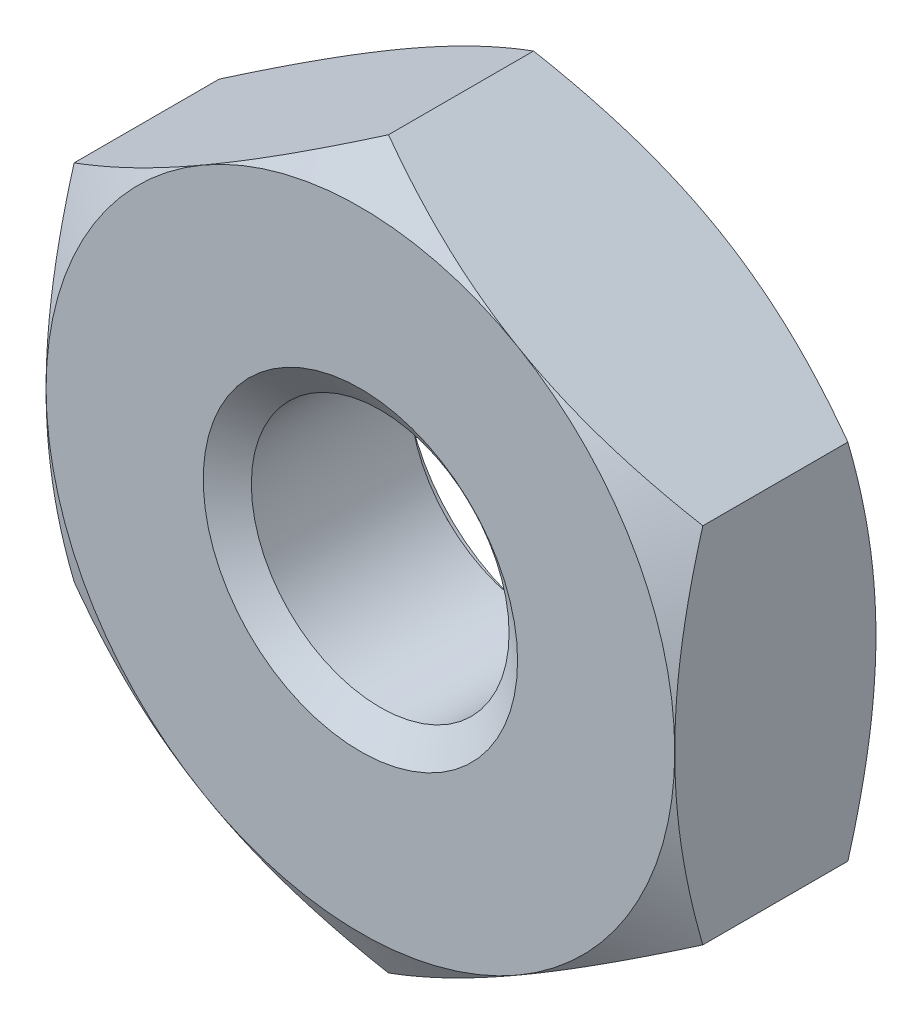
ISO-10303-21;
HEADER;
FILE_DESCRIPTION(('STEP AP214'),'2;1');
FILE_NAME('part.step','',(''),(''),'','','');
FILE_SCHEMA(('AUTOMOTIVE_DESIGN { 1 0 10303 214 1 1 1 1 }'));
ENDSEC;
DATA;
#1=APPLICATION_CONTEXT('core data for automotive mechanical design processes');
#2=APPLICATION_PROTOCOL_DEFINITION('international standard','automotive_design',2000,#1);
#3=PRODUCT_CONTEXT('',#1,'mechanical');
#4=PRODUCT('Part','Part','',(#3));
#5=PRODUCT_RELATED_PRODUCT_CATEGORY('part','',(#4));
#6=PRODUCT_DEFINITION_FORMATION('','',#4);
#7=PRODUCT_DEFINITION_CONTEXT('part definition',#1,'design');
#8=PRODUCT_DEFINITION('design','',#6,#7);
#9=PRODUCT_DEFINITION_SHAPE('','',#8);
#10=(LENGTH_UNIT() NAMED_UNIT(*) SI_UNIT(.MILLI.,.METRE.));
#11=(NAMED_UNIT(*) PLANE_ANGLE_UNIT() SI_UNIT($,.RADIAN.));
#12=(NAMED_UNIT(*) SI_UNIT($,.STERADIAN.) SOLID_ANGLE_UNIT());
#13=UNCERTAINTY_MEASURE_WITH_UNIT(LENGTH_MEASURE(1.E-05),#10,'distance_accuracy_value','');
#14=(GEOMETRIC_REPRESENTATION_CONTEXT(3) GLOBAL_UNCERTAINTY_ASSIGNED_CONTEXT((#13)) GLOBAL_UNIT_ASSIGNED_CONTEXT((#10,
#11,#12)) REPRESENTATION_CONTEXT('',''));
#15=CARTESIAN_POINT('',(0.,0.,0.));
#16=DIRECTION('',(0.,0.,1.));
#17=DIRECTION('',(1.,0.,0.));
#18=AXIS2_PLACEMENT_3D('',#15,#16,#17);
#19=CARTESIAN_POINT('',(0.,0.,-1.6));
#20=DIRECTION('',(0.,0.,1.));
#21=DIRECTION('',(1.,0.,0.));
#22=AXIS2_PLACEMENT_3D('',#19,#20,#21);
#23=CYLINDRICAL_SURFACE('',#22,1.025);
#24=CARTESIAN_POINT('',(0.,0.,-0.157546696097185));
#25=DIRECTION('',(0.,0.,1.));
#26=DIRECTION('',(1.,0.,0.));
#27=AXIS2_PLACEMENT_3D('',#24,#25,#26);
#28=CIRCLE('',#27,1.025);
#29=CARTESIAN_POINT('',(1.025,0.,-0.157546696097185));
#30=VERTEX_POINT('',#29);
#31=EDGE_CURVE('E166',#30,#30,#28,.F.);
#32=ORIENTED_EDGE('',*,*,#31,.F.);
#33=EDGE_LOOP('',(#32));
#34=FACE_BOUND('',#33,.T.);
#35=CARTESIAN_POINT('',(0.,0.,-1.41705330390281));
#36=DIRECTION('',(0.,0.,-1.));
#37=DIRECTION('',(-1.,0.,0.));
#38=AXIS2_PLACEMENT_3D('',#35,#36,#37);
#39=CIRCLE('',#38,1.025);
#40=CARTESIAN_POINT('',(-1.025,0.,-1.41705330390281));
#41=VERTEX_POINT('',#40);
#42=EDGE_CURVE('E31',#41,#41,#39,.F.);
#43=ORIENTED_EDGE('',*,*,#42,.F.);
#44=EDGE_LOOP('',(#43));
#45=FACE_BOUND('',#44,.T.);
#46=ADVANCED_FACE('F26',(#34,#45),#23,.F.);
#47=CARTESIAN_POINT('',(0.,2.88675134594814,-1.6));
#48=DIRECTION('',(0.,0.,-1.));
#49=DIRECTION('',(-1.,0.,0.));
#50=AXIS2_PLACEMENT_3D('',#47,#48,#49);
#51=PLANE('',#50);
#52=CARTESIAN_POINT('',(0.,0.,-1.6));
#53=DIRECTION('',(0.,0.,-1.));
#54=DIRECTION('',(-1.,0.,0.));
#55=AXIS2_PLACEMENT_3D('',#52,#53,#54);
#56=CIRCLE('',#55,2.5);
#57=CARTESIAN_POINT('',(-2.5,0.,-1.6));
#58=VERTEX_POINT('',#57);
#59=CARTESIAN_POINT('',(-1.25000000000002,-2.16506350946108,-1.6));
#60=VERTEX_POINT('',#59);
#61=EDGE_CURVE('E162',#58,#60,#56,.F.);
#62=ORIENTED_EDGE('',*,*,#61,.F.);
#63=CARTESIAN_POINT('',(-1.25000000000001,2.16506350946109,-1.6));
#64=VERTEX_POINT('',#63);
#65=EDGE_CURVE('E144',#64,#58,#56,.F.);
#66=ORIENTED_EDGE('',*,*,#65,.F.);
#67=CARTESIAN_POINT('',(1.25000000000003,2.16506350946108,-1.6));
#68=VERTEX_POINT('',#67);
#69=EDGE_CURVE('E161',#68,#64,#56,.F.);
#70=ORIENTED_EDGE('',*,*,#69,.F.);
#71=CARTESIAN_POINT('',(0.,0.,-1.6));
#72=DIRECTION('',(0.,0.,1.));
#73=DIRECTION('',(1.,0.,0.));
#74=AXIS2_PLACEMENT_3D('',#71,#72,#73);
#75=CIRCLE('',#74,2.5);
#76=CARTESIAN_POINT('',(2.5,0.,-1.6));
#77=VERTEX_POINT('',#76);
#78=EDGE_CURVE('E236',#77,#68,#75,.T.);
#79=ORIENTED_EDGE('',*,*,#78,.F.);
#80=CARTESIAN_POINT('',(1.25,-2.16506350946109,-1.6));
#81=VERTEX_POINT('',#80);
#82=EDGE_CURVE('E368',#81,#77,#56,.F.);
#83=ORIENTED_EDGE('',*,*,#82,.F.);
#84=EDGE_CURVE('E389',#60,#81,#56,.F.);
#85=ORIENTED_EDGE('',*,*,#84,.F.);
#86=EDGE_LOOP('',(#62,#66,#70,#79,#83,#85));
#87=FACE_BOUND('',#86,.T.);
#88=CARTESIAN_POINT('',(0.,0.,-1.6));
#89=DIRECTION('',(0.,0.,-1.));
#90=DIRECTION('',(-1.,0.,0.));
#91=AXIS2_PLACEMENT_3D('',#88,#89,#90);
#92=CIRCLE('',#91,1.25);
#93=CARTESIAN_POINT('',(-1.25,0.,-1.6));
#94=VERTEX_POINT('',#93);
#95=EDGE_CURVE('E169',#94,#94,#92,.F.);
#96=ORIENTED_EDGE('',*,*,#95,.T.);
#97=EDGE_LOOP('',(#96));
#98=FACE_BOUND('',#97,.T.);
#99=ADVANCED_FACE('F241',(#87,#98),#51,.T.);
#100=CARTESIAN_POINT('',(0.,2.88675134594814,0.));
#101=DIRECTION('',(0.,0.,-1.));
#102=DIRECTION('',(-1.,0.,0.));
#103=AXIS2_PLACEMENT_3D('',#100,#101,#102);
#104=PLANE('',#103);
#105=CARTESIAN_POINT('',(0.,0.,0.));
#106=DIRECTION('',(0.,0.,-1.));
#107=DIRECTION('',(-1.,0.,0.));
#108=AXIS2_PLACEMENT_3D('',#105,#106,#107);
#109=CIRCLE('',#108,2.5);
#110=CARTESIAN_POINT('',(-2.5,0.,0.));
#111=VERTEX_POINT('',#110);
#112=CARTESIAN_POINT('',(-1.25000000000001,2.16506350946109,0.));
#113=VERTEX_POINT('',#112);
#114=EDGE_CURVE('E11',#111,#113,#109,.T.);
#115=ORIENTED_EDGE('',*,*,#114,.F.);
#116=CARTESIAN_POINT('',(-1.25000000000002,-2.16506350946108,0.));
#117=VERTEX_POINT('',#116);
#118=EDGE_CURVE('E38',#117,#111,#109,.T.);
#119=ORIENTED_EDGE('',*,*,#118,.F.);
#120=CARTESIAN_POINT('',(1.25,-2.16506350946109,0.));
#121=VERTEX_POINT('',#120);
#122=EDGE_CURVE('E165',#121,#117,#109,.T.);
#123=ORIENTED_EDGE('',*,*,#122,.F.);
#124=CARTESIAN_POINT('',(2.5,0.,0.));
#125=VERTEX_POINT('',#124);
#126=EDGE_CURVE('E334',#125,#121,#109,.T.);
#127=ORIENTED_EDGE('',*,*,#126,.F.);
#128=CARTESIAN_POINT('',(0.,0.,0.));
#129=DIRECTION('',(0.,0.,1.));
#130=DIRECTION('',(1.,0.,0.));
#131=AXIS2_PLACEMENT_3D('',#128,#129,#130);
#132=CIRCLE('',#131,2.5);
#133=CARTESIAN_POINT('',(1.25000000000003,2.16506350946108,0.));
#134=VERTEX_POINT('',#133);
#135=EDGE_CURVE('E120',#125,#134,#132,.T.);
#136=ORIENTED_EDGE('',*,*,#135,.T.);
#137=EDGE_CURVE('E36',#113,#134,#109,.T.);
#138=ORIENTED_EDGE('',*,*,#137,.F.);
#139=EDGE_LOOP('',(#115,#119,#123,#127,#136,#138));
#140=FACE_BOUND('',#139,.T.);
#141=CARTESIAN_POINT('',(0.,0.,0.));
#142=DIRECTION('',(0.,0.,1.));
#143=DIRECTION('',(1.,0.,0.));
#144=AXIS2_PLACEMENT_3D('',#141,#142,#143);
#145=CIRCLE('',#144,1.25);
#146=CARTESIAN_POINT('',(1.25,0.,0.));
#147=VERTEX_POINT('',#146);
#148=EDGE_CURVE('E168',#147,#147,#145,.T.);
#149=ORIENTED_EDGE('',*,*,#148,.F.);
#150=EDGE_LOOP('',(#149));
#151=FACE_BOUND('',#150,.T.);
#152=ADVANCED_FACE('F294',(#140,#151),#104,.F.);
#153=CARTESIAN_POINT('',(0.,2.88675134594814,-1.6));
#154=DIRECTION('',(-0.500000000000003,0.866025403784437,0.));
#155=DIRECTION('',(-0.866025403784437,-0.500000000000003,0.));
#156=AXIS2_PLACEMENT_3D('',#153,#154,#155);
#157=PLANE('',#156);
#158=DIRECTION('',(0.,0.,1.));
#159=VECTOR('',#158,1.);
#160=CARTESIAN_POINT('',(-2.5,1.44337567297406,-1.6));
#161=LINE('',#160,#159);
#162=CARTESIAN_POINT('',(-2.5,1.44337567297409,-1.3767090063074));
#163=VERTEX_POINT('',#162);
#164=CARTESIAN_POINT('',(-2.5,1.44337567297406,-0.223290993692597));
#165=VERTEX_POINT('',#164);
#166=EDGE_CURVE('E156',#163,#165,#161,.T.);
#167=ORIENTED_EDGE('',*,*,#166,.T.);
#168=CARTESIAN_POINT('',(-2.5002,1.44326020292022,-0.223357664359103));
#169=CARTESIAN_POINT('',(-2.39033676526513,1.50668977106844,-0.186721620107621));
#170=CARTESIAN_POINT('',(-2.27952520010347,1.57066685804385,-0.153402218965052));
#171=CARTESIAN_POINT('',(-2.05598316653395,1.69972891130041,-0.095242285557855));
#172=CARTESIAN_POINT('',(-1.94324872547161,1.76481617119469,-0.070422329147736));
#173=CARTESIAN_POINT('',(-1.71917700612473,1.89418403867739,-0.0317856514410506));
#174=CARTESIAN_POINT('',(-1.60787420823263,1.95844473900196,-0.0177117961856379));
#175=CARTESIAN_POINT('',(-1.38474477253167,2.08726857876804,-0.0009091523527495));
#176=CARTESIAN_POINT('',(-1.27291894598578,2.15183124982666,0.00183354879637425));
#177=CARTESIAN_POINT('',(-1.06395802444848,2.27247489412633,-0.00386576000805269));
#178=CARTESIAN_POINT('',(-0.966791682442271,2.32857390783979,-0.0109083943818611));
#179=CARTESIAN_POINT('',(-0.773092050288997,2.44040644260542,-0.0332314191249424));
#180=CARTESIAN_POINT('',(-0.676559430340266,2.4961395767184,-0.0485194384402671));
#181=CARTESIAN_POINT('',(-0.48246027825952,2.60820277442169,-0.0867390938444209));
#182=CARTESIAN_POINT('',(-0.384918318217854,2.66451865130903,-0.109832776125518));
#183=CARTESIAN_POINT('',(-0.191289391923907,2.77631036402774,-0.162246656577915));
#184=CARTESIAN_POINT('',(-0.0951999441138142,2.83178763258718,-0.191554535624551));
#185=CARTESIAN_POINT('',(0.000200000000011263,2.88686681600198,-0.223357664359112));
#186=B_SPLINE_CURVE_WITH_KNOTS('',3,(#168,#169,#170,#171,#172,#173,#174,#175,#176,#177,#178,
#179,#180,#181,#182,#183,#184,#185),.UNSPECIFIED.,.F.,.F.,(4,2,2,2,2,2,2,2,4),(0.,
0.396285827362225,0.793524330152048,1.18093086852114,1.56786160134475,1.90479741793733,
2.24204551660463,2.58677531536757,2.93082800105258),.UNSPECIFIED.);
#187=EDGE_CURVE('E125',#165,#113,#186,.T.);
#188=ORIENTED_EDGE('',*,*,#187,.T.);
#189=CARTESIAN_POINT('',(0.,2.88675134594814,-0.223290993692605));
#190=VERTEX_POINT('',#189);
#191=EDGE_CURVE('E45',#113,#190,#186,.T.);
#192=ORIENTED_EDGE('',*,*,#191,.T.);
#193=DIRECTION('',(0.,0.,1.));
#194=VECTOR('',#193,1.);
#195=CARTESIAN_POINT('',(0.,2.88675134594814,-1.6));
#196=LINE('',#195,#194);
#197=CARTESIAN_POINT('',(0.,2.88675134594814,-1.3767090063074));
#198=VERTEX_POINT('',#197);
#199=EDGE_CURVE('E141',#198,#190,#196,.T.);
#200=ORIENTED_EDGE('',*,*,#199,.F.);
#201=CARTESIAN_POINT('',(-2.5002,1.44326020292022,-1.3766423356409));
#202=CARTESIAN_POINT('',(-2.39033676526513,1.50668977106844,-1.41327837989238));
#203=CARTESIAN_POINT('',(-2.27952520010347,1.57066685804385,-1.44659778103495));
#204=CARTESIAN_POINT('',(-2.05598316653395,1.69972891130041,-1.50475771444215));
#205=CARTESIAN_POINT('',(-1.94324872547161,1.76481617119469,-1.52957767085226));
#206=CARTESIAN_POINT('',(-1.71917700612473,1.89418403867739,-1.56821434855895));
#207=CARTESIAN_POINT('',(-1.60787420823263,1.95844473900196,-1.58228820381436));
#208=CARTESIAN_POINT('',(-1.38474477253167,2.08726857876804,-1.59909084764725));
#209=CARTESIAN_POINT('',(-1.27291894598578,2.15183124982666,-1.60183354879637));
#210=CARTESIAN_POINT('',(-1.06395802444848,2.27247489412633,-1.59613423999195));
#211=CARTESIAN_POINT('',(-0.966791682442271,2.32857390783979,-1.58909160561814));
#212=CARTESIAN_POINT('',(-0.773092050288997,2.44040644260542,-1.56676858087506));
#213=CARTESIAN_POINT('',(-0.676559430340266,2.4961395767184,-1.55148056155973));
#214=CARTESIAN_POINT('',(-0.48246027825952,2.60820277442169,-1.51326090615558));
#215=CARTESIAN_POINT('',(-0.384918318217854,2.66451865130903,-1.49016722387448));
#216=CARTESIAN_POINT('',(-0.191289391923907,2.77631036402774,-1.43775334342209));
#217=CARTESIAN_POINT('',(-0.0951999441138142,2.83178763258718,-1.40844546437545));
#218=CARTESIAN_POINT('',(0.000200000000011264,2.88686681600198,-1.37664233564089));
#219=B_SPLINE_CURVE_WITH_KNOTS('',3,(#201,#202,#203,#204,#205,#206,#207,#208,#209,#210,#211,
#212,#213,#214,#215,#216,#217,#218),.UNSPECIFIED.,.F.,.F.,(4,2,2,2,2,2,2,2,4),(0.,
0.396285827362226,0.793524330152048,1.18093086852114,1.56786160134475,1.90479741793733,
2.24204551660463,2.58677531536757,2.93082800105258),.UNSPECIFIED.);
#220=EDGE_CURVE('E159',#64,#198,#219,.T.);
#221=ORIENTED_EDGE('',*,*,#220,.F.);
#222=EDGE_CURVE('E251',#163,#64,#219,.T.);
#223=ORIENTED_EDGE('',*,*,#222,.F.);
#224=EDGE_LOOP('',(#167,#188,#192,#200,#221,#223));
#225=FACE_BOUND('',#224,.T.);
#226=ADVANCED_FACE('F28',(#225),#157,.T.);
#227=CARTESIAN_POINT('',(2.5,1.44337567297404,-1.6));
#228=DIRECTION('',(0.50000000000001,0.866025403784433,0.));
#229=DIRECTION('',(-0.866025403784433,0.50000000000001,0.));
#230=AXIS2_PLACEMENT_3D('',#227,#228,#229);
#231=PLANE('',#230);
#232=ORIENTED_EDGE('',*,*,#199,.T.);
#233=CARTESIAN_POINT('',(-0.00019999999998845,2.88686681600198,-0.223357664359111));
#234=CARTESIAN_POINT('',(0.109663234734882,2.82343724785375,-0.186721620107629));
#235=CARTESIAN_POINT('',(0.220474799896536,2.75946016087835,-0.153402218965059));
#236=CARTESIAN_POINT('',(0.444016833466059,2.63039810762178,-0.0952422855578602));
#237=CARTESIAN_POINT('',(0.556751274528397,2.5653108477275,-0.0704223291477404));
#238=CARTESIAN_POINT('',(0.780822993875276,2.43594298024479,-0.0317856514410532));
#239=CARTESIAN_POINT('',(0.892125791767383,2.37168227992022,-0.0177117961856395));
#240=CARTESIAN_POINT('',(1.11525522746834,2.24285844015414,-0.000909152352749658));
#241=CARTESIAN_POINT('',(1.22708105401423,2.17829576909552,0.00183354879637448));
#242=CARTESIAN_POINT('',(1.43604197555152,2.05765212479585,-0.00386576000805121));
#243=CARTESIAN_POINT('',(1.53320831755773,2.00155311108239,-0.0109083943818587));
#244=CARTESIAN_POINT('',(1.72690794971101,1.88972057631676,-0.0332314191249383));
#245=CARTESIAN_POINT('',(1.82344056965973,1.83398744220378,-0.0485194384402623));
#246=CARTESIAN_POINT('',(2.01753972174048,1.72192424450048,-0.0867390938444143));
#247=CARTESIAN_POINT('',(2.11508168178214,1.66560836761314,-0.109832776125511));
#248=CARTESIAN_POINT('',(2.30871060807609,1.55381665489443,-0.162246656577906));
#249=CARTESIAN_POINT('',(2.40480005588618,1.49833938633499,-0.191554535624541));
#250=CARTESIAN_POINT('',(2.5002,1.4432602029202,-0.2233576643591));
#251=B_SPLINE_CURVE_WITH_KNOTS('',3,(#233,#234,#235,#236,#237,#238,#239,#240,#241,#242,#243,
#244,#245,#246,#247,#248,#249,#250),.UNSPECIFIED.,.F.,.F.,(4,2,2,2,2,2,2,2,4),(0.,
0.396285827362227,0.793524330152052,1.18093086852114,1.56786160134476,1.90479741793733,
2.24204551660463,2.58677531536757,2.93082800105257),.UNSPECIFIED.);
#252=EDGE_CURVE('E135',#190,#134,#251,.T.);
#253=ORIENTED_EDGE('',*,*,#252,.T.);
#254=CARTESIAN_POINT('',(2.5,1.44337567297408,-0.223290993692605));
#255=VERTEX_POINT('',#254);
#256=EDGE_CURVE('E52',#134,#255,#251,.T.);
#257=ORIENTED_EDGE('',*,*,#256,.T.);
#258=DIRECTION('',(0.,0.,1.));
#259=VECTOR('',#258,1.);
#260=CARTESIAN_POINT('',(2.5,1.44337567297404,-1.6));
#261=LINE('',#260,#259);
#262=CARTESIAN_POINT('',(2.5,1.44337567297408,-1.3767090063074));
#263=VERTEX_POINT('',#262);
#264=EDGE_CURVE('E134',#263,#255,#261,.T.);
#265=ORIENTED_EDGE('',*,*,#264,.F.);
#266=CARTESIAN_POINT('',(-0.00019999999998845,2.88686681600198,-1.37664233564089));
#267=CARTESIAN_POINT('',(0.109663234734882,2.82343724785375,-1.41327837989237));
#268=CARTESIAN_POINT('',(0.220474799896536,2.75946016087835,-1.44659778103494));
#269=CARTESIAN_POINT('',(0.444016833466058,2.63039810762178,-1.50475771444214));
#270=CARTESIAN_POINT('',(0.556751274528396,2.5653108477275,-1.52957767085226));
#271=CARTESIAN_POINT('',(0.780822993875275,2.43594298024479,-1.56821434855895));
#272=CARTESIAN_POINT('',(0.892125791767383,2.37168227992022,-1.58228820381436));
#273=CARTESIAN_POINT('',(1.11525522746834,2.24285844015414,-1.59909084764725));
#274=CARTESIAN_POINT('',(1.22708105401423,2.17829576909552,-1.60183354879638));
#275=CARTESIAN_POINT('',(1.43604197555152,2.05765212479585,-1.59613423999195));
#276=CARTESIAN_POINT('',(1.53320831755773,2.00155311108239,-1.58909160561814));
#277=CARTESIAN_POINT('',(1.72690794971101,1.88972057631676,-1.56676858087506));
#278=CARTESIAN_POINT('',(1.82344056965974,1.83398744220378,-1.55148056155974));
#279=CARTESIAN_POINT('',(2.01753972174048,1.72192424450048,-1.51326090615559));
#280=CARTESIAN_POINT('',(2.11508168178214,1.66560836761314,-1.49016722387449));
#281=CARTESIAN_POINT('',(2.30871060807609,1.55381665489443,-1.4377533434221));
#282=CARTESIAN_POINT('',(2.40480005588618,1.49833938633499,-1.40844546437546));
#283=CARTESIAN_POINT('',(2.5002,1.4432602029202,-1.3766423356409));
#284=B_SPLINE_CURVE_WITH_KNOTS('',3,(#266,#267,#268,#269,#270,#271,#272,#273,#274,#275,#276,
#277,#278,#279,#280,#281,#282,#283),.UNSPECIFIED.,.F.,.F.,(4,2,2,2,2,2,2,2,4),(0.,
0.396285827362227,0.793524330152051,1.18093086852114,1.56786160134476,1.90479741793733,
2.24204551660463,2.58677531536757,2.93082800105257),.UNSPECIFIED.);
#285=EDGE_CURVE('E245',#68,#263,#284,.T.);
#286=ORIENTED_EDGE('',*,*,#285,.F.);
#287=EDGE_CURVE('E250',#198,#68,#284,.T.);
#288=ORIENTED_EDGE('',*,*,#287,.F.);
#289=EDGE_LOOP('',(#232,#253,#257,#265,#286,#288));
#290=FACE_BOUND('',#289,.T.);
#291=ADVANCED_FACE('F132',(#290),#231,.T.);
#292=CARTESIAN_POINT('',(2.5,1.44337567297404,-1.6));
#293=DIRECTION('',(-1.,0.,0.));
#294=DIRECTION('',(0.,0.,1.));
#295=AXIS2_PLACEMENT_3D('',#292,#293,#294);
#296=PLANE('',#295);
#297=CARTESIAN_POINT('',(2.5,-3.82804499372437,-1.1963167632754));
#298=CARTESIAN_POINT('',(2.5,-3.71828085649177,-1.14327266922931));
#299=CARTESIAN_POINT('',(2.5,-3.60825720059558,-1.09075587737962));
#300=CARTESIAN_POINT('',(2.5,-3.38755052986225,-0.98707821674823));
#301=CARTESIAN_POINT('',(2.5,-3.27686740487458,-0.935917582729522));
#302=CARTESIAN_POINT('',(2.5,-3.05410357303962,-0.834984039411602));
#303=CARTESIAN_POINT('',(2.5,-2.94201849305855,-0.785220746914403));
#304=CARTESIAN_POINT('',(2.5,-2.71692709217043,-0.68783161588769));
#305=CARTESIAN_POINT('',(2.5,-2.60392081964714,-0.640205665942517));
#306=CARTESIAN_POINT('',(2.5,-2.37540441715614,-0.547094156496482));
#307=CARTESIAN_POINT('',(2.5,-2.25988058014234,-0.501642052634909));
#308=CARTESIAN_POINT('',(2.5,-2.02747029246859,-0.414297644349644));
#309=CARTESIAN_POINT('',(2.5,-1.91058369184879,-0.372405735979072));
#310=CARTESIAN_POINT('',(2.5,-1.6755019890861,-0.293307342769308));
#311=CARTESIAN_POINT('',(2.5,-1.55731027320533,-0.256090896739906));
#312=CARTESIAN_POINT('',(2.5,-1.3192465914741,-0.187552097840324));
#313=CARTESIAN_POINT('',(2.5,-1.19937516991096,-0.156227881047977));
#314=CARTESIAN_POINT('',(2.5,-0.95787020436378,-0.100994246846283));
#315=CARTESIAN_POINT('',(2.5,-0.836236200197841,-0.0770868037228439));
#316=CARTESIAN_POINT('',(2.5,-0.591501703670376,-0.0382963974514701));
#317=CARTESIAN_POINT('',(2.5,-0.468401210012389,-0.0234134422823167));
#318=CARTESIAN_POINT('',(2.5,-0.222157493517493,-0.00398863321840113));
#319=CARTESIAN_POINT('',(2.5,-0.0990195694337861,0.000618687975648278));
#320=CARTESIAN_POINT('',(2.5,0.14717005350464,-0.000752541484248236));
#321=CARTESIAN_POINT('',(2.5,0.2702217664451,-0.00672834425959449));
#322=CARTESIAN_POINT('',(2.5,0.480350397015922,-0.0255492091334931));
#323=CARTESIAN_POINT('',(2.5,0.567659136488612,-0.035943310027442));
#324=CARTESIAN_POINT('',(2.5,0.741602181646835,-0.0613833814666798));
#325=CARTESIAN_POINT('',(2.5,0.828236378756311,-0.076430085661526));
#326=CARTESIAN_POINT('',(2.5,1.08705653408104,-0.12775941934389));
#327=CARTESIAN_POINT('',(2.5,1.2580293158045,-0.170218054015716));
#328=CARTESIAN_POINT('',(2.5,1.51386408134076,-0.243447724573247));
#329=CARTESIAN_POINT('',(2.5,1.60005960225961,-0.269821213632267));
#330=CARTESIAN_POINT('',(2.5,1.77155099438377,-0.325177862642346));
#331=CARTESIAN_POINT('',(2.5,1.85684744139723,-0.354159222616814));
#332=CARTESIAN_POINT('',(2.5,2.02618400322713,-0.414128561987673));
#333=CARTESIAN_POINT('',(2.5,2.11022848716774,-0.445104328595931));
#334=CARTESIAN_POINT('',(2.5,2.27766538220571,-0.508873971119182));
#335=CARTESIAN_POINT('',(2.5,2.36105751399617,-0.541668581852099));
#336=CARTESIAN_POINT('',(2.5,2.44414811866678,-0.575193129088613));
#337=B_SPLINE_CURVE_WITH_KNOTS('',3,(#297,#298,#299,#300,#301,#302,#303,#304,#305,#306,#307,
#308,#309,#310,#311,#312,#313,#314,#315,#316,#317,#318,#319,#320,#321,#322,#323,#324,#325,#326,
#327,#328,#329,#330,#331,#332,#333,#334,#335,#336),.UNSPECIFIED.,.F.,.F.,(4,2,2,2,2,2,2,2,2,2,2,
2,2,2,2,2,2,2,2,4),(0.,0.365732370332671,0.731527644124545,1.09941621653744,1.46728558928017,
1.83967125623428,2.21209829506681,2.58371790436001,2.9552197586967,3.32682041917404,
3.69842140819259,4.06764803658774,4.4367788103743,4.70042588015952,4.96411454456777,
5.49188432099896,5.76228301186059,6.03249648197689,6.3011890091436,6.56999089095297),.UNSPECIFIED.);
#338=CARTESIAN_POINT('',(2.49999999999998,-1.44337567297411,-0.223290993692605));
#339=VERTEX_POINT('',#338);
#340=EDGE_CURVE('E127',#339,#125,#337,.T.);
#341=ORIENTED_EDGE('',*,*,#340,.F.);
#342=DIRECTION('',(0.,0.,1.));
#343=VECTOR('',#342,1.);
#344=CARTESIAN_POINT('',(2.5,-1.4433756729741,-1.6));
#345=LINE('',#344,#343);
#346=CARTESIAN_POINT('',(2.49999999999998,-1.44337567297411,-1.3767090063074));
#347=VERTEX_POINT('',#346);
#348=EDGE_CURVE('E142',#347,#339,#345,.T.);
#349=ORIENTED_EDGE('',*,*,#348,.F.);
#350=CARTESIAN_POINT('',(2.5,-3.82804499372437,-0.4036832367246));
#351=CARTESIAN_POINT('',(2.5,-3.71828085649177,-0.456727330770687));
#352=CARTESIAN_POINT('',(2.5,-3.60825720059558,-0.509244122620375));
#353=CARTESIAN_POINT('',(2.5,-3.38755052986225,-0.61292178325177));
#354=CARTESIAN_POINT('',(2.5,-3.27686740487459,-0.664082417270478));
#355=CARTESIAN_POINT('',(2.5,-3.05410357303963,-0.765015960588398));
#356=CARTESIAN_POINT('',(2.5,-2.94201849305855,-0.814779253085597));
#357=CARTESIAN_POINT('',(2.5,-2.71692709217043,-0.912168384112309));
#358=CARTESIAN_POINT('',(2.5,-2.60392081964715,-0.959794334057482));
#359=CARTESIAN_POINT('',(2.5,-2.37540441715614,-1.05290584350352));
#360=CARTESIAN_POINT('',(2.5,-2.25988058014235,-1.09835794736509));
#361=CARTESIAN_POINT('',(2.5,-2.02747029246859,-1.18570235565036));
#362=CARTESIAN_POINT('',(2.5,-1.91058369184879,-1.22759426402093));
#363=CARTESIAN_POINT('',(2.5,-1.6755019890861,-1.30669265723069));
#364=CARTESIAN_POINT('',(2.5,-1.55731027320534,-1.34390910326009));
#365=CARTESIAN_POINT('',(2.5,-1.3192465914741,-1.41244790215968));
#366=CARTESIAN_POINT('',(2.5,-1.19937516991096,-1.44377211895202));
#367=CARTESIAN_POINT('',(2.5,-0.957870204363781,-1.49900575315372));
#368=CARTESIAN_POINT('',(2.5,-0.836236200197841,-1.52291319627716));
#369=CARTESIAN_POINT('',(2.5,-0.591501703670376,-1.56170360254853));
#370=CARTESIAN_POINT('',(2.5,-0.468401210012388,-1.57658655771768));
#371=CARTESIAN_POINT('',(2.5,-0.222157493517493,-1.5960113667816));
#372=CARTESIAN_POINT('',(2.5,-0.0990195694337857,-1.60061868797565));
#373=CARTESIAN_POINT('',(2.5,0.14717005350464,-1.59924745851575));
#374=CARTESIAN_POINT('',(2.5,0.270221766445101,-1.59327165574041));
#375=CARTESIAN_POINT('',(2.5,0.480350397015922,-1.57445079086651));
#376=CARTESIAN_POINT('',(2.5,0.567659136488612,-1.56405668997256));
#377=CARTESIAN_POINT('',(2.5,0.741602181646835,-1.53861661853332));
#378=CARTESIAN_POINT('',(2.5,0.828236378756311,-1.52356991433847));
#379=CARTESIAN_POINT('',(2.5,1.08705653408104,-1.47224058065611));
#380=CARTESIAN_POINT('',(2.5,1.2580293158045,-1.42978194598428));
#381=CARTESIAN_POINT('',(2.5,1.51386408134076,-1.35655227542675));
#382=CARTESIAN_POINT('',(2.5,1.6000596022596,-1.33017878636773));
#383=CARTESIAN_POINT('',(2.5,1.77155099438377,-1.27482213735766));
#384=CARTESIAN_POINT('',(2.5,1.85684744139723,-1.24584077738319));
#385=CARTESIAN_POINT('',(2.5,2.02618400322713,-1.18587143801233));
#386=CARTESIAN_POINT('',(2.5,2.11022848716773,-1.15489567140407));
#387=CARTESIAN_POINT('',(2.5,2.27766538220571,-1.09112602888082));
#388=CARTESIAN_POINT('',(2.5,2.36105751399617,-1.0583314181479));
#389=CARTESIAN_POINT('',(2.5,2.44414811866678,-1.02480687091139));
#390=B_SPLINE_CURVE_WITH_KNOTS('',3,(#350,#351,#352,#353,#354,#355,#356,#357,#358,#359,#360,
#361,#362,#363,#364,#365,#366,#367,#368,#369,#370,#371,#372,#373,#374,#375,#376,#377,#378,#379,
#380,#381,#382,#383,#384,#385,#386,#387,#388,#389),.UNSPECIFIED.,.F.,.F.,(4,2,2,2,2,2,2,2,2,2,2,
2,2,2,2,2,2,2,2,4),(0.,0.365732370332671,0.731527644124544,1.09941621653744,1.46728558928017,
1.83967125623428,2.21209829506681,2.58371790436001,2.9552197586967,3.32682041917404,
3.69842140819259,4.06764803658774,4.4367788103743,4.70042588015952,4.96411454456777,
5.49188432099896,5.76228301186059,6.03249648197689,6.3011890091436,6.56999089095297),.UNSPECIFIED.);
#391=EDGE_CURVE('E257',#347,#77,#390,.T.);
#392=ORIENTED_EDGE('',*,*,#391,.T.);
#393=EDGE_CURVE('E140',#77,#263,#390,.T.);
#394=ORIENTED_EDGE('',*,*,#393,.T.);
#395=ORIENTED_EDGE('',*,*,#264,.T.);
#396=EDGE_CURVE('E117',#125,#255,#337,.T.);
#397=ORIENTED_EDGE('',*,*,#396,.F.);
#398=EDGE_LOOP('',(#341,#349,#392,#394,#395,#397));
#399=FACE_BOUND('',#398,.T.);
#400=ADVANCED_FACE('F138',(#399),#296,.F.);
#401=CARTESIAN_POINT('',(0.,-2.88675134594817,-1.6));
#402=DIRECTION('',(0.500000000000001,-0.866025403784438,0.));
#403=DIRECTION('',(0.866025403784438,0.500000000000001,0.));
#404=AXIS2_PLACEMENT_3D('',#401,#402,#403);
#405=PLANE('',#404);
#406=ORIENTED_EDGE('',*,*,#348,.T.);
#407=CARTESIAN_POINT('',(2.5002,-1.44326020292026,-0.223357664359118));
#408=CARTESIAN_POINT('',(2.39033676526513,-1.50668977106848,-0.186721620107636));
#409=CARTESIAN_POINT('',(2.27952520010348,-1.57066685804389,-0.153402218965067));
#410=CARTESIAN_POINT('',(2.05598316653395,-1.69972891130045,-0.0952422855578711));
#411=CARTESIAN_POINT('',(1.94324872547161,-1.76481617119474,-0.0704223291477528));
#412=CARTESIAN_POINT('',(1.71917700612473,-1.89418403867744,-0.0317856514410685));
#413=CARTESIAN_POINT('',(1.60787420823262,-1.95844473900201,-0.0177117961856562));
#414=CARTESIAN_POINT('',(1.38474477253166,-2.08726857876809,-0.000909152352769273));
#415=CARTESIAN_POINT('',(1.27291894598577,-2.15183124982671,0.00183354879635338));
#416=CARTESIAN_POINT('',(1.06395802444847,-2.27247489412638,-0.00386576000807509));
#417=CARTESIAN_POINT('',(0.966791682442263,-2.32857390783984,-0.0109083943818838));
#418=CARTESIAN_POINT('',(0.773092050288992,-2.44040644260546,-0.0332314191249656));
#419=CARTESIAN_POINT('',(0.676559430340263,-2.49613957671844,-0.0485194384402905));
#420=CARTESIAN_POINT('',(0.482460278259519,-2.60820277442173,-0.0867390938444441));
#421=CARTESIAN_POINT('',(0.384918318217855,-2.66451865130907,-0.109832776125541));
#422=CARTESIAN_POINT('',(0.191289391923911,-2.77631036402778,-0.162246656577937));
#423=CARTESIAN_POINT('',(0.09519994411382,-2.83178763258722,-0.191554535624572));
#424=CARTESIAN_POINT('',(-0.000200000000004054,-2.88686681600201,-0.223357664359131));
#425=B_SPLINE_CURVE_WITH_KNOTS('',3,(#407,#408,#409,#410,#411,#412,#413,#414,#415,#416,#417,
#418,#419,#420,#421,#422,#423,#424),.UNSPECIFIED.,.F.,.F.,(4,2,2,2,2,2,2,2,4),(0.,
0.396285827362229,0.793524330152055,1.18093086852115,1.56786160134476,1.90479741793734,
2.24204551660464,2.58677531536757,2.93082800105257),.UNSPECIFIED.);
#426=EDGE_CURVE('E337',#339,#121,#425,.T.);
#427=ORIENTED_EDGE('',*,*,#426,.T.);
#428=CARTESIAN_POINT('',(0.,-2.88675134594814,-0.223290993692605));
#429=VERTEX_POINT('',#428);
#430=EDGE_CURVE('E217',#121,#429,#425,.T.);
#431=ORIENTED_EDGE('',*,*,#430,.T.);
#432=DIRECTION('',(0.,0.,1.));
#433=VECTOR('',#432,1.);
#434=CARTESIAN_POINT('',(0.,-2.88675134594817,-1.6));
#435=LINE('',#434,#433);
#436=CARTESIAN_POINT('',(0.,-2.88675134594814,-1.3767090063074));
#437=VERTEX_POINT('',#436);
#438=EDGE_CURVE('E147',#437,#429,#435,.T.);
#439=ORIENTED_EDGE('',*,*,#438,.F.);
#440=CARTESIAN_POINT('',(2.5002,-1.44326020292026,-1.37664233564088));
#441=CARTESIAN_POINT('',(2.39033676526513,-1.50668977106848,-1.41327837989236));
#442=CARTESIAN_POINT('',(2.27952520010348,-1.57066685804389,-1.44659778103493));
#443=CARTESIAN_POINT('',(2.05598316653395,-1.69972891130045,-1.50475771444213));
#444=CARTESIAN_POINT('',(1.94324872547161,-1.76481617119474,-1.52957767085225));
#445=CARTESIAN_POINT('',(1.71917700612473,-1.89418403867744,-1.56821434855893));
#446=CARTESIAN_POINT('',(1.60787420823262,-1.95844473900201,-1.58228820381434));
#447=CARTESIAN_POINT('',(1.38474477253166,-2.08726857876809,-1.59909084764723));
#448=CARTESIAN_POINT('',(1.27291894598577,-2.15183124982671,-1.60183354879635));
#449=CARTESIAN_POINT('',(1.06395802444847,-2.27247489412638,-1.59613423999193));
#450=CARTESIAN_POINT('',(0.966791682442263,-2.32857390783984,-1.58909160561812));
#451=CARTESIAN_POINT('',(0.773092050288992,-2.44040644260546,-1.56676858087504));
#452=CARTESIAN_POINT('',(0.676559430340263,-2.49613957671844,-1.55148056155971));
#453=CARTESIAN_POINT('',(0.482460278259519,-2.60820277442173,-1.51326090615556));
#454=CARTESIAN_POINT('',(0.384918318217855,-2.66451865130907,-1.49016722387446));
#455=CARTESIAN_POINT('',(0.191289391923911,-2.77631036402778,-1.43775334342206));
#456=CARTESIAN_POINT('',(0.09519994411382,-2.83178763258722,-1.40844546437543));
#457=CARTESIAN_POINT('',(-0.000200000000004052,-2.88686681600201,-1.37664233564087));
#458=B_SPLINE_CURVE_WITH_KNOTS('',3,(#440,#441,#442,#443,#444,#445,#446,#447,#448,#449,#450,
#451,#452,#453,#454,#455,#456,#457),.UNSPECIFIED.,.F.,.F.,(4,2,2,2,2,2,2,2,4),(0.,
0.396285827362229,0.793524330152055,1.18093086852115,1.56786160134476,1.90479741793734,
2.24204551660464,2.58677531536757,2.93082800105257),.UNSPECIFIED.);
#459=EDGE_CURVE('E263',#81,#437,#458,.T.);
#460=ORIENTED_EDGE('',*,*,#459,.F.);
#461=EDGE_CURVE('E262',#347,#81,#458,.T.);
#462=ORIENTED_EDGE('',*,*,#461,.F.);
#463=EDGE_LOOP('',(#406,#427,#431,#439,#460,#462));
#464=FACE_BOUND('',#463,.T.);
#465=ADVANCED_FACE('F273',(#464),#405,.T.);
#466=CARTESIAN_POINT('',(-2.5,-1.44337567297408,-1.6));
#467=DIRECTION('',(-0.500000000000008,-0.866025403784434,0.));
#468=DIRECTION('',(0.866025403784434,-0.500000000000008,0.));
#469=AXIS2_PLACEMENT_3D('',#466,#467,#468);
#470=PLANE('',#469);
#471=ORIENTED_EDGE('',*,*,#438,.T.);
#472=CARTESIAN_POINT('',(0.000199999999995725,-2.88686681600201,-0.223357664359131));
#473=CARTESIAN_POINT('',(-0.109663234734876,-2.82343724785379,-0.186721620107648));
#474=CARTESIAN_POINT('',(-0.220474799896532,-2.75946016087838,-0.153402218965078));
#475=CARTESIAN_POINT('',(-0.444016833466057,-2.63039810762182,-0.0952422855578785));
#476=CARTESIAN_POINT('',(-0.556751274528397,-2.56531084772753,-0.0704223291477584));
#477=CARTESIAN_POINT('',(-0.780822993875279,-2.43594298024482,-0.0317856514410707));
#478=CARTESIAN_POINT('',(-0.892125791767388,-2.37168227992025,-0.017711796185657));
#479=CARTESIAN_POINT('',(-1.11525522746835,-2.24285844015417,-0.000909152352766776));
#480=CARTESIAN_POINT('',(-1.22708105401424,-2.17829576909555,0.0018335487963576));
#481=CARTESIAN_POINT('',(-1.43604197555153,-2.05765212479588,-0.00386576000806794));
#482=CARTESIAN_POINT('',(-1.53320831755774,-2.00155311108242,-0.0109083943818753));
#483=CARTESIAN_POINT('',(-1.72690794971101,-1.8897205763168,-0.0332314191249543));
#484=CARTESIAN_POINT('',(-1.82344056965974,-1.83398744220382,-0.0485194384402778));
#485=CARTESIAN_POINT('',(-2.01753972174048,-1.72192424450052,-0.0867390938444288));
#486=CARTESIAN_POINT('',(-2.11508168178214,-1.66560836761318,-0.109832776125524));
#487=CARTESIAN_POINT('',(-2.30871060807609,-1.55381665489447,-0.162246656577918));
#488=CARTESIAN_POINT('',(-2.40480005588618,-1.49833938633503,-0.191554535624552));
#489=CARTESIAN_POINT('',(-2.5002,-1.44326020292024,-0.22335766435911));
#490=B_SPLINE_CURVE_WITH_KNOTS('',3,(#472,#473,#474,#475,#476,#477,#478,#479,#480,#481,#482,
#483,#484,#485,#486,#487,#488,#489),.UNSPECIFIED.,.F.,.F.,(4,2,2,2,2,2,2,2,4),(0.,
0.396285827362232,0.793524330152061,1.18093086852116,1.56786160134477,1.90479741793735,
2.24204551660464,2.58677531536757,2.93082800105257),.UNSPECIFIED.);
#491=EDGE_CURVE('E340',#429,#117,#490,.T.);
#492=ORIENTED_EDGE('',*,*,#491,.T.);
#493=CARTESIAN_POINT('',(-2.5,-1.44337567297409,-0.223290993692605));
#494=VERTEX_POINT('',#493);
#495=EDGE_CURVE('E191',#117,#494,#490,.T.);
#496=ORIENTED_EDGE('',*,*,#495,.T.);
#497=DIRECTION('',(0.,0.,1.));
#498=VECTOR('',#497,1.);
#499=CARTESIAN_POINT('',(-2.5,-1.44337567297408,-1.6));
#500=LINE('',#499,#498);
#501=CARTESIAN_POINT('',(-2.5,-1.44337567297409,-1.3767090063074));
#502=VERTEX_POINT('',#501);
#503=EDGE_CURVE('E153',#502,#494,#500,.T.);
#504=ORIENTED_EDGE('',*,*,#503,.F.);
#505=CARTESIAN_POINT('',(0.000199999999995725,-2.88686681600201,-1.37664233564087));
#506=CARTESIAN_POINT('',(-0.109663234734876,-2.82343724785379,-1.41327837989235));
#507=CARTESIAN_POINT('',(-0.220474799896532,-2.75946016087838,-1.44659778103492));
#508=CARTESIAN_POINT('',(-0.444016833466057,-2.63039810762182,-1.50475771444212));
#509=CARTESIAN_POINT('',(-0.556751274528397,-2.56531084772753,-1.52957767085224));
#510=CARTESIAN_POINT('',(-0.780822993875279,-2.43594298024482,-1.56821434855893));
#511=CARTESIAN_POINT('',(-0.892125791767388,-2.37168227992025,-1.58228820381434));
#512=CARTESIAN_POINT('',(-1.11525522746835,-2.24285844015417,-1.59909084764723));
#513=CARTESIAN_POINT('',(-1.22708105401424,-2.17829576909555,-1.60183354879636));
#514=CARTESIAN_POINT('',(-1.43604197555153,-2.05765212479588,-1.59613423999193));
#515=CARTESIAN_POINT('',(-1.53320831755774,-2.00155311108242,-1.58909160561813));
#516=CARTESIAN_POINT('',(-1.72690794971101,-1.8897205763168,-1.56676858087505));
#517=CARTESIAN_POINT('',(-1.82344056965974,-1.83398744220382,-1.55148056155972));
#518=CARTESIAN_POINT('',(-2.01753972174048,-1.72192424450052,-1.51326090615557));
#519=CARTESIAN_POINT('',(-2.11508168178214,-1.66560836761318,-1.49016722387448));
#520=CARTESIAN_POINT('',(-2.30871060807609,-1.55381665489447,-1.43775334342208));
#521=CARTESIAN_POINT('',(-2.40480005588618,-1.49833938633503,-1.40844546437545));
#522=CARTESIAN_POINT('',(-2.5002,-1.44326020292024,-1.37664233564089));
#523=B_SPLINE_CURVE_WITH_KNOTS('',3,(#505,#506,#507,#508,#509,#510,#511,#512,#513,#514,#515,
#516,#517,#518,#519,#520,#521,#522),.UNSPECIFIED.,.F.,.F.,(4,2,2,2,2,2,2,2,4),(0.,
0.396285827362232,0.793524330152061,1.18093086852116,1.56786160134477,1.90479741793735,
2.24204551660464,2.58677531536757,2.93082800105257),.UNSPECIFIED.);
#524=EDGE_CURVE('E269',#60,#502,#523,.T.);
#525=ORIENTED_EDGE('',*,*,#524,.F.);
#526=EDGE_CURVE('E268',#437,#60,#523,.T.);
#527=ORIENTED_EDGE('',*,*,#526,.F.);
#528=EDGE_LOOP('',(#471,#492,#496,#504,#525,#527));
#529=FACE_BOUND('',#528,.T.);
#530=ADVANCED_FACE('F276',(#529),#470,.T.);
#531=CARTESIAN_POINT('',(-2.5,1.44337567297406,-1.6));
#532=DIRECTION('',(-1.,0.,0.));
#533=DIRECTION('',(0.,0.,1.));
#534=AXIS2_PLACEMENT_3D('',#531,#532,#533);
#535=PLANE('',#534);
#536=ORIENTED_EDGE('',*,*,#503,.T.);
#537=CARTESIAN_POINT('',(-2.5,-3.82804499372434,-1.19631676327539));
#538=CARTESIAN_POINT('',(-2.5,-3.71828085649174,-1.1432726692293));
#539=CARTESIAN_POINT('',(-2.5,-3.60825720059555,-1.09075587737961));
#540=CARTESIAN_POINT('',(-2.5,-3.38755052986223,-0.987078216748216));
#541=CARTESIAN_POINT('',(-2.5,-3.27686740487456,-0.935917582729509));
#542=CARTESIAN_POINT('',(-2.5,-3.0541035730396,-0.834984039411589));
#543=CARTESIAN_POINT('',(-2.5,-2.94201849305852,-0.78522074691439));
#544=CARTESIAN_POINT('',(-2.5,-2.71692709217041,-0.687831615887679));
#545=CARTESIAN_POINT('',(-2.5,-2.60392081964712,-0.640205665942506));
#546=CARTESIAN_POINT('',(-2.5,-2.37540441715612,-0.547094156496472));
#547=CARTESIAN_POINT('',(-2.5,-2.25988058014232,-0.501642052634899));
#548=CARTESIAN_POINT('',(-2.5,-2.02747029246856,-0.414297644349635));
#549=CARTESIAN_POINT('',(-2.5,-1.91058369184877,-0.372405735979063));
#550=CARTESIAN_POINT('',(-2.5,-1.67550198908608,-0.2933073427693));
#551=CARTESIAN_POINT('',(-2.5,-1.55731027320531,-0.256090896739897));
#552=CARTESIAN_POINT('',(-2.5,-1.31924659147408,-0.187552097840317));
#553=CARTESIAN_POINT('',(-2.5,-1.19937516991094,-0.15622788104797));
#554=CARTESIAN_POINT('',(-2.5,-0.957870204363761,-0.100994246846277));
#555=CARTESIAN_POINT('',(-2.5,-0.836236200197822,-0.0770868037228384));
#556=CARTESIAN_POINT('',(-2.5,-0.591501703670359,-0.0382963974514655));
#557=CARTESIAN_POINT('',(-2.5,-0.468401210012371,-0.0234134422823126));
#558=CARTESIAN_POINT('',(-2.5,-0.222157493517477,-0.00398863321839822));
#559=CARTESIAN_POINT('',(-2.5,-0.0990195694337701,0.000618687975650497));
#560=CARTESIAN_POINT('',(-2.5,0.147170053504654,-0.00075254148424695));
#561=CARTESIAN_POINT('',(-2.5,0.270221766445115,-0.00672834425959344));
#562=CARTESIAN_POINT('',(-2.5,0.480350397015936,-0.0255492091334927));
#563=CARTESIAN_POINT('',(-2.5,0.567659136488626,-0.0359433100274419));
#564=CARTESIAN_POINT('',(-2.5,0.74160218164685,-0.0613833814666803));
#565=CARTESIAN_POINT('',(-2.5,0.828236378756327,-0.0764300856615268));
#566=CARTESIAN_POINT('',(-2.5,1.08705653408106,-0.127759419343892));
#567=CARTESIAN_POINT('',(-2.5,1.25802931580452,-0.170218054015719));
#568=CARTESIAN_POINT('',(-2.5,1.51386408134078,-0.24344772457325));
#569=CARTESIAN_POINT('',(-2.5,1.60005960225962,-0.269821213632271));
#570=CARTESIAN_POINT('',(-2.5,1.77155099438378,-0.32517786264235));
#571=CARTESIAN_POINT('',(-2.5,1.85684744139725,-0.354159222616819));
#572=CARTESIAN_POINT('',(-2.5,2.02618400322715,-0.414128561987678));
#573=CARTESIAN_POINT('',(-2.5,2.11022848716776,-0.445104328595937));
#574=CARTESIAN_POINT('',(-2.5,2.27766538220573,-0.508873971119188));
#575=CARTESIAN_POINT('',(-2.5,2.36105751399619,-0.541668581852106));
#576=CARTESIAN_POINT('',(-2.5,2.4441481186668,-0.575193129088621));
#577=B_SPLINE_CURVE_WITH_KNOTS('',3,(#537,#538,#539,#540,#541,#542,#543,#544,#545,#546,#547,
#548,#549,#550,#551,#552,#553,#554,#555,#556,#557,#558,#559,#560,#561,#562,#563,#564,#565,#566,
#567,#568,#569,#570,#571,#572,#573,#574,#575,#576),.UNSPECIFIED.,.F.,.F.,(4,2,2,2,2,2,2,2,2,2,2,
2,2,2,2,2,2,2,2,4),(0.,0.36573237033267,0.731527644124543,1.09941621653743,1.46728558928017,
1.83967125623427,2.2120982950668,2.58371790436,2.95521975869669,3.32682041917403,
3.69842140819257,4.06764803658772,4.43677881037428,4.70042588015951,4.96411454456775,
5.49188432099895,5.76228301186057,6.03249648197688,6.30118900914359,6.56999089095296),.UNSPECIFIED.);
#578=EDGE_CURVE('E190',#494,#111,#577,.T.);
#579=ORIENTED_EDGE('',*,*,#578,.T.);
#580=EDGE_CURVE('E183',#111,#165,#577,.T.);
#581=ORIENTED_EDGE('',*,*,#580,.T.);
#582=ORIENTED_EDGE('',*,*,#166,.F.);
#583=CARTESIAN_POINT('',(-2.5,-3.82804499372434,-0.403683236724614));
#584=CARTESIAN_POINT('',(-2.5,-3.71828085649174,-0.456727330770702));
#585=CARTESIAN_POINT('',(-2.5,-3.60825720059555,-0.50924412262039));
#586=CARTESIAN_POINT('',(-2.5,-3.38755052986223,-0.612921783251784));
#587=CARTESIAN_POINT('',(-2.5,-3.27686740487456,-0.664082417270491));
#588=CARTESIAN_POINT('',(-2.5,-3.0541035730396,-0.765015960588411));
#589=CARTESIAN_POINT('',(-2.5,-2.94201849305853,-0.81477925308561));
#590=CARTESIAN_POINT('',(-2.5,-2.71692709217041,-0.912168384112321));
#591=CARTESIAN_POINT('',(-2.5,-2.60392081964712,-0.959794334057494));
#592=CARTESIAN_POINT('',(-2.5,-2.37540441715612,-1.05290584350353));
#593=CARTESIAN_POINT('',(-2.5,-2.25988058014232,-1.0983579473651));
#594=CARTESIAN_POINT('',(-2.5,-2.02747029246856,-1.18570235565037));
#595=CARTESIAN_POINT('',(-2.5,-1.91058369184877,-1.22759426402094));
#596=CARTESIAN_POINT('',(-2.5,-1.67550198908608,-1.3066926572307));
#597=CARTESIAN_POINT('',(-2.5,-1.55731027320531,-1.3439091032601));
#598=CARTESIAN_POINT('',(-2.5,-1.31924659147408,-1.41244790215968));
#599=CARTESIAN_POINT('',(-2.5,-1.19937516991094,-1.44377211895203));
#600=CARTESIAN_POINT('',(-2.5,-0.957870204363761,-1.49900575315372));
#601=CARTESIAN_POINT('',(-2.5,-0.836236200197822,-1.52291319627716));
#602=CARTESIAN_POINT('',(-2.5,-0.591501703670359,-1.56170360254854));
#603=CARTESIAN_POINT('',(-2.5,-0.468401210012371,-1.57658655771769));
#604=CARTESIAN_POINT('',(-2.5,-0.222157493517477,-1.5960113667816));
#605=CARTESIAN_POINT('',(-2.5,-0.0990195694337701,-1.60061868797565));
#606=CARTESIAN_POINT('',(-2.5,0.147170053504655,-1.59924745851575));
#607=CARTESIAN_POINT('',(-2.5,0.270221766445115,-1.59327165574041));
#608=CARTESIAN_POINT('',(-2.5,0.480350397015936,-1.57445079086651));
#609=CARTESIAN_POINT('',(-2.5,0.567659136488626,-1.56405668997256));
#610=CARTESIAN_POINT('',(-2.5,0.74160218164685,-1.53861661853332));
#611=CARTESIAN_POINT('',(-2.5,0.828236378756327,-1.52356991433847));
#612=CARTESIAN_POINT('',(-2.5,1.08705653408106,-1.47224058065611));
#613=CARTESIAN_POINT('',(-2.5,1.25802931580452,-1.42978194598428));
#614=CARTESIAN_POINT('',(-2.5,1.51386408134078,-1.35655227542675));
#615=CARTESIAN_POINT('',(-2.5,1.60005960225962,-1.33017878636773));
#616=CARTESIAN_POINT('',(-2.5,1.77155099438378,-1.27482213735765));
#617=CARTESIAN_POINT('',(-2.5,1.85684744139725,-1.24584077738318));
#618=CARTESIAN_POINT('',(-2.5,2.02618400322715,-1.18587143801232));
#619=CARTESIAN_POINT('',(-2.5,2.11022848716776,-1.15489567140406));
#620=CARTESIAN_POINT('',(-2.5,2.27766538220573,-1.09112602888081));
#621=CARTESIAN_POINT('',(-2.5,2.36105751399619,-1.0583314181479));
#622=CARTESIAN_POINT('',(-2.5,2.4441481186668,-1.02480687091138));
#623=B_SPLINE_CURVE_WITH_KNOTS('',3,(#583,#584,#585,#586,#587,#588,#589,#590,#591,#592,#593,
#594,#595,#596,#597,#598,#599,#600,#601,#602,#603,#604,#605,#606,#607,#608,#609,#610,#611,#612,
#613,#614,#615,#616,#617,#618,#619,#620,#621,#622),.UNSPECIFIED.,.F.,.F.,(4,2,2,2,2,2,2,2,2,2,2,
2,2,2,2,2,2,2,2,4),(0.,0.365732370332669,0.731527644124542,1.09941621653743,1.46728558928017,
1.83967125623427,2.2120982950668,2.58371790436,2.95521975869669,3.32682041917403,
3.69842140819257,4.06764803658772,4.43677881037428,4.70042588015951,4.96411454456775,
5.49188432099895,5.76228301186057,6.03249648197688,6.30118900914359,6.56999089095296),.UNSPECIFIED.);
#624=EDGE_CURVE('E352',#58,#163,#623,.T.);
#625=ORIENTED_EDGE('',*,*,#624,.F.);
#626=EDGE_CURVE('E354',#502,#58,#623,.T.);
#627=ORIENTED_EDGE('',*,*,#626,.F.);
#628=EDGE_LOOP('',(#536,#579,#581,#582,#625,#627));
#629=FACE_BOUND('',#628,.T.);
#630=ADVANCED_FACE('F197',(#629),#535,.T.);
#631=CARTESIAN_POINT('',(0.,0.,-1.6));
#632=DIRECTION('',(0.,0.,1.));
#633=DIRECTION('',(1.,0.,0.));
#634=AXIS2_PLACEMENT_3D('',#631,#632,#633);
#635=CONICAL_SURFACE('',#634,2.5,1.0471975511966);
#636=ORIENTED_EDGE('',*,*,#222,.T.);
#637=ORIENTED_EDGE('',*,*,#65,.T.);
#638=ORIENTED_EDGE('',*,*,#624,.T.);
#639=EDGE_LOOP('',(#636,#637,#638));
#640=FACE_BOUND('',#639,.T.);
#641=ADVANCED_FACE('F286',(#640),#635,.T.);
#642=ORIENTED_EDGE('',*,*,#220,.T.);
#643=ORIENTED_EDGE('',*,*,#287,.T.);
#644=ORIENTED_EDGE('',*,*,#69,.T.);
#645=EDGE_LOOP('',(#642,#643,#644));
#646=FACE_BOUND('',#645,.T.);
#647=ADVANCED_FACE('F370',(#646),#635,.T.);
#648=ORIENTED_EDGE('',*,*,#285,.T.);
#649=ORIENTED_EDGE('',*,*,#393,.F.);
#650=ORIENTED_EDGE('',*,*,#78,.T.);
#651=EDGE_LOOP('',(#648,#649,#650));
#652=FACE_BOUND('',#651,.T.);
#653=ADVANCED_FACE('F363',(#652),#635,.T.);
#654=ORIENTED_EDGE('',*,*,#461,.T.);
#655=ORIENTED_EDGE('',*,*,#82,.T.);
#656=ORIENTED_EDGE('',*,*,#391,.F.);
#657=EDGE_LOOP('',(#654,#655,#656));
#658=FACE_BOUND('',#657,.T.);
#659=ADVANCED_FACE('F376',(#658),#635,.T.);
#660=ORIENTED_EDGE('',*,*,#459,.T.);
#661=ORIENTED_EDGE('',*,*,#526,.T.);
#662=ORIENTED_EDGE('',*,*,#84,.T.);
#663=EDGE_LOOP('',(#660,#661,#662));
#664=FACE_BOUND('',#663,.T.);
#665=ADVANCED_FACE('F377',(#664),#635,.T.);
#666=ORIENTED_EDGE('',*,*,#524,.T.);
#667=ORIENTED_EDGE('',*,*,#626,.T.);
#668=ORIENTED_EDGE('',*,*,#61,.T.);
#669=EDGE_LOOP('',(#666,#667,#668));
#670=FACE_BOUND('',#669,.T.);
#671=ADVANCED_FACE('F205',(#670),#635,.T.);
#672=CARTESIAN_POINT('',(0.,0.,0.));
#673=DIRECTION('',(0.,0.,-1.));
#674=DIRECTION('',(-1.,0.,0.));
#675=AXIS2_PLACEMENT_3D('',#672,#673,#674);
#676=CONICAL_SURFACE('',#675,2.5,1.0471975511966);
#677=ORIENTED_EDGE('',*,*,#118,.T.);
#678=ORIENTED_EDGE('',*,*,#578,.F.);
#679=ORIENTED_EDGE('',*,*,#495,.F.);
#680=EDGE_LOOP('',(#677,#678,#679));
#681=FACE_BOUND('',#680,.T.);
#682=ADVANCED_FACE('F199',(#681),#676,.T.);
#683=ORIENTED_EDGE('',*,*,#122,.T.);
#684=ORIENTED_EDGE('',*,*,#491,.F.);
#685=ORIENTED_EDGE('',*,*,#430,.F.);
#686=EDGE_LOOP('',(#683,#684,#685));
#687=FACE_BOUND('',#686,.T.);
#688=ADVANCED_FACE('F204',(#687),#676,.T.);
#689=ORIENTED_EDGE('',*,*,#340,.T.);
#690=ORIENTED_EDGE('',*,*,#126,.T.);
#691=ORIENTED_EDGE('',*,*,#426,.F.);
#692=EDGE_LOOP('',(#689,#690,#691));
#693=FACE_BOUND('',#692,.T.);
#694=ADVANCED_FACE('F322',(#693),#676,.T.);
#695=ORIENTED_EDGE('',*,*,#135,.F.);
#696=ORIENTED_EDGE('',*,*,#396,.T.);
#697=ORIENTED_EDGE('',*,*,#256,.F.);
#698=EDGE_LOOP('',(#695,#696,#697));
#699=FACE_BOUND('',#698,.T.);
#700=ADVANCED_FACE('F118',(#699),#676,.T.);
#701=ORIENTED_EDGE('',*,*,#137,.T.);
#702=ORIENTED_EDGE('',*,*,#252,.F.);
#703=ORIENTED_EDGE('',*,*,#191,.F.);
#704=EDGE_LOOP('',(#701,#702,#703));
#705=FACE_BOUND('',#704,.T.);
#706=ADVANCED_FACE('F207',(#705),#676,.T.);
#707=ORIENTED_EDGE('',*,*,#580,.F.);
#708=ORIENTED_EDGE('',*,*,#114,.T.);
#709=ORIENTED_EDGE('',*,*,#187,.F.);
#710=EDGE_LOOP('',(#707,#708,#709));
#711=FACE_BOUND('',#710,.T.);
#712=ADVANCED_FACE('F314',(#711),#676,.T.);
#713=CARTESIAN_POINT('',(0.,0.,-0.173301365706903));
#714=DIRECTION('',(0.,0.,1.));
#715=DIRECTION('',(1.,0.,0.));
#716=AXIS2_PLACEMENT_3D('',#713,#714,#715);
#717=CONICAL_SURFACE('',#716,1.0025,0.959931088596868);
#718=ORIENTED_EDGE('',*,*,#148,.T.);
#719=EDGE_LOOP('',(#718));
#720=FACE_BOUND('',#719,.T.);
#721=ORIENTED_EDGE('',*,*,#31,.T.);
#722=EDGE_LOOP('',(#721));
#723=FACE_BOUND('',#722,.T.);
#724=ADVANCED_FACE('F208',(#720,#723),#717,.F.);
#725=CARTESIAN_POINT('',(0.,0.,-1.5746));
#726=DIRECTION('',(0.,0.,-1.));
#727=DIRECTION('',(-1.,0.,0.));
#728=AXIS2_PLACEMENT_3D('',#725,#726,#727);
#729=CONICAL_SURFACE('',#728,1.25,0.959931088596855);
#730=CARTESIAN_POINT('',(0.,0.,-1.5746));
#731=DIRECTION('',(0.,0.,1.));
#732=DIRECTION('',(1.,0.,0.));
#733=AXIS2_PLACEMENT_3D('',#730,#731,#732);
#734=CIRCLE('',#733,1.25);
#735=CARTESIAN_POINT('',(1.25,0.,-1.5746));
#736=VERTEX_POINT('',#735);
#737=EDGE_CURVE('E171',#736,#736,#734,.T.);
#738=ORIENTED_EDGE('',*,*,#737,.F.);
#739=EDGE_LOOP('',(#738));
#740=FACE_BOUND('',#739,.T.);
#741=ORIENTED_EDGE('',*,*,#42,.T.);
#742=EDGE_LOOP('',(#741));
#743=FACE_BOUND('',#742,.T.);
#744=ADVANCED_FACE('F313',(#740,#743),#729,.F.);
#745=CARTESIAN_POINT('',(0.,0.,-25.0375057290932));
#746=DIRECTION('',(0.,0.,1.));
#747=DIRECTION('',(1.,0.,0.));
#748=AXIS2_PLACEMENT_3D('',#745,#746,#747);
#749=CYLINDRICAL_SURFACE('',#748,1.25);
#750=ORIENTED_EDGE('',*,*,#95,.F.);
#751=EDGE_LOOP('',(#750));
#752=FACE_BOUND('',#751,.T.);
#753=ORIENTED_EDGE('',*,*,#737,.T.);
#754=EDGE_LOOP('',(#753));
#755=FACE_BOUND('',#754,.T.);
#756=ADVANCED_FACE('F318',(#752,#755),#749,.F.);
#757=CLOSED_SHELL('',(#46,#99,#152,#226,#291,#400,#465,#530,#630,#641,#647,#653,#659,#665,#671,
#682,#688,#694,#700,#706,#712,#724,#744,#756));
#758=MANIFOLD_SOLID_BREP('B2',#757);
#759=ADVANCED_BREP_SHAPE_REPRESENTATION('',(#18,#758),#14);
#760=SHAPE_DEFINITION_REPRESENTATION(#9,#759);
ENDSEC;
END-ISO-10303-21;
